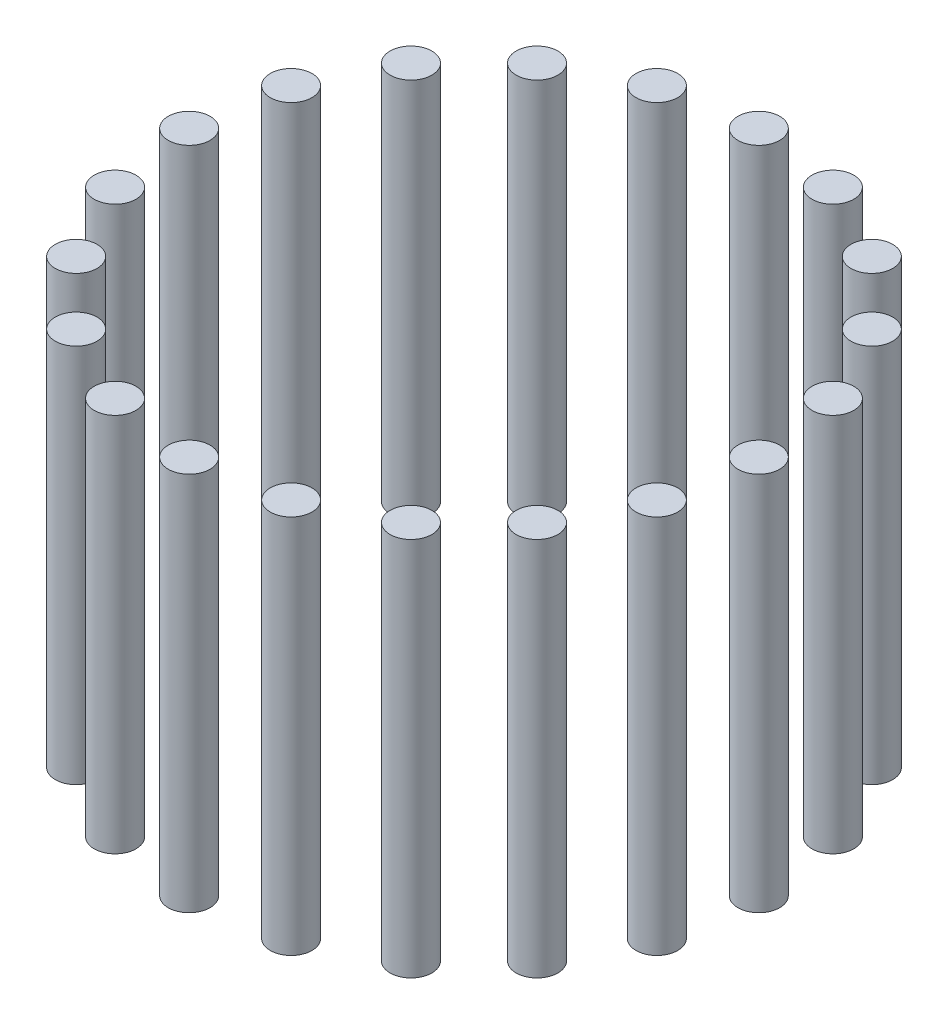
ISO-10303-21;
HEADER;
FILE_DESCRIPTION(('STEP AP214'),'2;1');
FILE_NAME('part.step','',(''),(''),'','','');
FILE_SCHEMA(('AUTOMOTIVE_DESIGN { 1 0 10303 214 1 1 1 1 }'));
ENDSEC;
DATA;
#1=APPLICATION_CONTEXT('core data for automotive mechanical design processes');
#2=APPLICATION_PROTOCOL_DEFINITION('international standard','automotive_design',2000,#1);
#3=PRODUCT_CONTEXT('',#1,'mechanical');
#4=PRODUCT('Part','Part','',(#3));
#5=PRODUCT_RELATED_PRODUCT_CATEGORY('part','',(#4));
#6=PRODUCT_DEFINITION_FORMATION('','',#4);
#7=PRODUCT_DEFINITION_CONTEXT('part definition',#1,'design');
#8=PRODUCT_DEFINITION('design','',#6,#7);
#9=PRODUCT_DEFINITION_SHAPE('','',#8);
#10=(LENGTH_UNIT() NAMED_UNIT(*) SI_UNIT(.MILLI.,.METRE.));
#11=(NAMED_UNIT(*) PLANE_ANGLE_UNIT() SI_UNIT($,.RADIAN.));
#12=(NAMED_UNIT(*) SI_UNIT($,.STERADIAN.) SOLID_ANGLE_UNIT());
#13=UNCERTAINTY_MEASURE_WITH_UNIT(LENGTH_MEASURE(1.E-05),#10,'distance_accuracy_value','');
#14=(GEOMETRIC_REPRESENTATION_CONTEXT(3) GLOBAL_UNCERTAINTY_ASSIGNED_CONTEXT((#13)) GLOBAL_UNIT_ASSIGNED_CONTEXT((#10,
#11,#12)) REPRESENTATION_CONTEXT('',''));
#15=CARTESIAN_POINT('',(0.,0.,0.));
#16=DIRECTION('',(0.,0.,1.));
#17=DIRECTION('',(1.,0.,0.));
#18=AXIS2_PLACEMENT_3D('',#15,#16,#17);
#19=CARTESIAN_POINT('',(-23.1762745781201,100.,-71.329238722135));
#20=DIRECTION('',(0.,-1.,0.));
#21=DIRECTION('',(0.,0.,-1.));
#22=AXIS2_PLACEMENT_3D('',#19,#20,#21);
#23=CYLINDRICAL_SURFACE('',#22,5.50000000000195);
#24=CARTESIAN_POINT('',(-23.1762745781201,100.,-71.329238722135));
#25=DIRECTION('',(0.,1.,0.));
#26=DIRECTION('',(0.,0.,1.));
#27=AXIS2_PLACEMENT_3D('',#24,#25,#26);
#28=CIRCLE('',#27,5.50000000000195);
#29=CARTESIAN_POINT('',(-23.1762745781201,100.,-65.829238722133));
#30=VERTEX_POINT('',#29);
#31=EDGE_CURVE('E48',#30,#30,#28,.T.);
#32=ORIENTED_EDGE('',*,*,#31,.F.);
#33=EDGE_LOOP('',(#32));
#34=FACE_BOUND('',#33,.T.);
#35=CARTESIAN_POINT('',(-23.1762745781201,0.,-71.329238722135));
#36=DIRECTION('',(0.,1.,0.));
#37=DIRECTION('',(0.,0.,1.));
#38=AXIS2_PLACEMENT_3D('',#35,#36,#37);
#39=CIRCLE('',#38,5.50000000000195);
#40=CARTESIAN_POINT('',(-23.1762745781201,0.,-65.829238722133));
#41=VERTEX_POINT('',#40);
#42=EDGE_CURVE('E11',#41,#41,#39,.T.);
#43=ORIENTED_EDGE('',*,*,#42,.T.);
#44=EDGE_LOOP('',(#43));
#45=FACE_BOUND('',#44,.T.);
#46=ADVANCED_FACE('F44',(#34,#45),#23,.T.);
#47=CARTESIAN_POINT('',(-23.1762745781201,100.,-71.329238722135));
#48=DIRECTION('',(0.,1.,0.));
#49=DIRECTION('',(0.,0.,1.));
#50=AXIS2_PLACEMENT_3D('',#47,#48,#49);
#51=PLANE('',#50);
#52=ORIENTED_EDGE('',*,*,#31,.T.);
#53=EDGE_LOOP('',(#52));
#54=FACE_BOUND('',#53,.T.);
#55=ADVANCED_FACE('F46',(#54),#51,.T.);
#56=CARTESIAN_POINT('',(-23.1762745781201,0.,-71.329238722135));
#57=DIRECTION('',(0.,1.,0.));
#58=DIRECTION('',(0.,0.,1.));
#59=AXIS2_PLACEMENT_3D('',#56,#57,#58);
#60=PLANE('',#59);
#61=ORIENTED_EDGE('',*,*,#42,.F.);
#62=EDGE_LOOP('',(#61));
#63=FACE_BOUND('',#62,.T.);
#64=ADVANCED_FACE('F63',(#63),#60,.F.);
#65=CLOSED_SHELL('',(#46,#55,#64));
#66=MANIFOLD_SOLID_BREP('B2',#65);
#67=CARTESIAN_POINT('',(-44.0838939219342,100.,-60.6762745781189));
#68=DIRECTION('',(0.,-1.,0.));
#69=DIRECTION('',(0.,0.,-1.));
#70=AXIS2_PLACEMENT_3D('',#67,#68,#69);
#71=CYLINDRICAL_SURFACE('',#70,5.50000000000278);
#72=CARTESIAN_POINT('',(-44.0838939219342,100.,-60.6762745781189));
#73=DIRECTION('',(0.,1.,0.));
#74=DIRECTION('',(0.,0.,1.));
#75=AXIS2_PLACEMENT_3D('',#72,#73,#74);
#76=CIRCLE('',#75,5.50000000000278);
#77=CARTESIAN_POINT('',(-44.0838939219342,100.,-55.1762745781162));
#78=VERTEX_POINT('',#77);
#79=EDGE_CURVE('E103',#78,#78,#76,.T.);
#80=ORIENTED_EDGE('',*,*,#79,.F.);
#81=EDGE_LOOP('',(#80));
#82=FACE_BOUND('',#81,.T.);
#83=CARTESIAN_POINT('',(-44.0838939219342,0.,-60.6762745781189));
#84=DIRECTION('',(0.,1.,0.));
#85=DIRECTION('',(0.,0.,1.));
#86=AXIS2_PLACEMENT_3D('',#83,#84,#85);
#87=CIRCLE('',#86,5.50000000000278);
#88=CARTESIAN_POINT('',(-44.0838939219342,0.,-55.1762745781162));
#89=VERTEX_POINT('',#88);
#90=EDGE_CURVE('E43',#89,#89,#87,.T.);
#91=ORIENTED_EDGE('',*,*,#90,.T.);
#92=EDGE_LOOP('',(#91));
#93=FACE_BOUND('',#92,.T.);
#94=ADVANCED_FACE('F99',(#82,#93),#71,.T.);
#95=CARTESIAN_POINT('',(-44.0838939219342,100.,-60.6762745781189));
#96=DIRECTION('',(0.,1.,0.));
#97=DIRECTION('',(0.,0.,1.));
#98=AXIS2_PLACEMENT_3D('',#95,#96,#97);
#99=PLANE('',#98);
#100=ORIENTED_EDGE('',*,*,#79,.T.);
#101=EDGE_LOOP('',(#100));
#102=FACE_BOUND('',#101,.T.);
#103=ADVANCED_FACE('F101',(#102),#99,.T.);
#104=CARTESIAN_POINT('',(-44.0838939219342,0.,-60.6762745781189));
#105=DIRECTION('',(0.,1.,0.));
#106=DIRECTION('',(0.,0.,1.));
#107=AXIS2_PLACEMENT_3D('',#104,#105,#106);
#108=PLANE('',#107);
#109=ORIENTED_EDGE('',*,*,#90,.F.);
#110=EDGE_LOOP('',(#109));
#111=FACE_BOUND('',#110,.T.);
#112=ADVANCED_FACE('F118',(#111),#108,.F.);
#113=CLOSED_SHELL('',(#94,#103,#112));
#114=MANIFOLD_SOLID_BREP('B6',#113);
#115=CARTESIAN_POINT('',(-60.6762745781193,100.,-44.0838939219329));
#116=DIRECTION('',(0.,-1.,0.));
#117=DIRECTION('',(0.,0.,-1.));
#118=AXIS2_PLACEMENT_3D('',#115,#116,#117);
#119=CYLINDRICAL_SURFACE('',#118,5.50000000000356);
#120=CARTESIAN_POINT('',(-60.6762745781193,100.,-44.0838939219329));
#121=DIRECTION('',(0.,1.,0.));
#122=DIRECTION('',(0.,0.,1.));
#123=AXIS2_PLACEMENT_3D('',#120,#121,#122);
#124=CIRCLE('',#123,5.50000000000356);
#125=CARTESIAN_POINT('',(-60.6762745781193,100.,-38.5838939219293));
#126=VERTEX_POINT('',#125);
#127=EDGE_CURVE('E158',#126,#126,#124,.T.);
#128=ORIENTED_EDGE('',*,*,#127,.F.);
#129=EDGE_LOOP('',(#128));
#130=FACE_BOUND('',#129,.T.);
#131=CARTESIAN_POINT('',(-60.6762745781193,0.,-44.0838939219329));
#132=DIRECTION('',(0.,1.,0.));
#133=DIRECTION('',(0.,0.,1.));
#134=AXIS2_PLACEMENT_3D('',#131,#132,#133);
#135=CIRCLE('',#134,5.50000000000356);
#136=CARTESIAN_POINT('',(-60.6762745781193,0.,-38.5838939219293));
#137=VERTEX_POINT('',#136);
#138=EDGE_CURVE('E98',#137,#137,#135,.T.);
#139=ORIENTED_EDGE('',*,*,#138,.T.);
#140=EDGE_LOOP('',(#139));
#141=FACE_BOUND('',#140,.T.);
#142=ADVANCED_FACE('F154',(#130,#141),#119,.T.);
#143=CARTESIAN_POINT('',(-60.6762745781193,100.,-44.0838939219329));
#144=DIRECTION('',(0.,1.,0.));
#145=DIRECTION('',(0.,0.,1.));
#146=AXIS2_PLACEMENT_3D('',#143,#144,#145);
#147=PLANE('',#146);
#148=ORIENTED_EDGE('',*,*,#127,.T.);
#149=EDGE_LOOP('',(#148));
#150=FACE_BOUND('',#149,.T.);
#151=ADVANCED_FACE('F156',(#150),#147,.T.);
#152=CARTESIAN_POINT('',(-60.6762745781193,0.,-44.0838939219329));
#153=DIRECTION('',(0.,1.,0.));
#154=DIRECTION('',(0.,0.,1.));
#155=AXIS2_PLACEMENT_3D('',#152,#153,#154);
#156=PLANE('',#155);
#157=ORIENTED_EDGE('',*,*,#138,.F.);
#158=EDGE_LOOP('',(#157));
#159=FACE_BOUND('',#158,.T.);
#160=ADVANCED_FACE('F173',(#159),#156,.F.);
#161=CLOSED_SHELL('',(#142,#151,#160));
#162=MANIFOLD_SOLID_BREP('B38',#161);
#163=CARTESIAN_POINT('',(-71.3292387221342,100.,-23.1762745781181));
#164=DIRECTION('',(0.,-1.,0.));
#165=DIRECTION('',(0.,0.,-1.));
#166=AXIS2_PLACEMENT_3D('',#163,#164,#165);
#167=CYLINDRICAL_SURFACE('',#166,5.50000000000451);
#168=CARTESIAN_POINT('',(-71.3292387221342,100.,-23.1762745781181));
#169=DIRECTION('',(0.,1.,0.));
#170=DIRECTION('',(0.,0.,1.));
#171=AXIS2_PLACEMENT_3D('',#168,#169,#170);
#172=CIRCLE('',#171,5.50000000000451);
#173=CARTESIAN_POINT('',(-71.3292387221342,100.,-17.6762745781136));
#174=VERTEX_POINT('',#173);
#175=EDGE_CURVE('E213',#174,#174,#172,.T.);
#176=ORIENTED_EDGE('',*,*,#175,.F.);
#177=EDGE_LOOP('',(#176));
#178=FACE_BOUND('',#177,.T.);
#179=CARTESIAN_POINT('',(-71.3292387221342,0.,-23.1762745781181));
#180=DIRECTION('',(0.,1.,0.));
#181=DIRECTION('',(0.,0.,1.));
#182=AXIS2_PLACEMENT_3D('',#179,#180,#181);
#183=CIRCLE('',#182,5.50000000000451);
#184=CARTESIAN_POINT('',(-71.3292387221342,0.,-17.6762745781136));
#185=VERTEX_POINT('',#184);
#186=EDGE_CURVE('E153',#185,#185,#183,.T.);
#187=ORIENTED_EDGE('',*,*,#186,.T.);
#188=EDGE_LOOP('',(#187));
#189=FACE_BOUND('',#188,.T.);
#190=ADVANCED_FACE('F209',(#178,#189),#167,.T.);
#191=CARTESIAN_POINT('',(-71.3292387221342,100.,-23.1762745781181));
#192=DIRECTION('',(0.,1.,0.));
#193=DIRECTION('',(0.,0.,1.));
#194=AXIS2_PLACEMENT_3D('',#191,#192,#193);
#195=PLANE('',#194);
#196=ORIENTED_EDGE('',*,*,#175,.T.);
#197=EDGE_LOOP('',(#196));
#198=FACE_BOUND('',#197,.T.);
#199=ADVANCED_FACE('F211',(#198),#195,.T.);
#200=CARTESIAN_POINT('',(-71.3292387221342,0.,-23.1762745781181));
#201=DIRECTION('',(0.,1.,0.));
#202=DIRECTION('',(0.,0.,1.));
#203=AXIS2_PLACEMENT_3D('',#200,#201,#202);
#204=PLANE('',#203);
#205=ORIENTED_EDGE('',*,*,#186,.F.);
#206=EDGE_LOOP('',(#205));
#207=FACE_BOUND('',#206,.T.);
#208=ADVANCED_FACE('F228',(#207),#204,.F.);
#209=CLOSED_SHELL('',(#190,#199,#208));
#210=MANIFOLD_SOLID_BREP('B93',#209);
#211=CARTESIAN_POINT('',(-74.9999999999969,100.,3.0739299994309E-12));
#212=DIRECTION('',(0.,-1.,0.));
#213=DIRECTION('',(0.,0.,-1.));
#214=AXIS2_PLACEMENT_3D('',#211,#212,#213);
#215=CYLINDRICAL_SURFACE('',#214,5.50000000000537);
#216=CARTESIAN_POINT('',(-74.9999999999969,100.,3.0739299994309E-12));
#217=DIRECTION('',(0.,1.,0.));
#218=DIRECTION('',(0.,0.,1.));
#219=AXIS2_PLACEMENT_3D('',#216,#217,#218);
#220=CIRCLE('',#219,5.50000000000537);
#221=CARTESIAN_POINT('',(-74.9999999999969,100.,5.50000000000844));
#222=VERTEX_POINT('',#221);
#223=EDGE_CURVE('E268',#222,#222,#220,.T.);
#224=ORIENTED_EDGE('',*,*,#223,.F.);
#225=EDGE_LOOP('',(#224));
#226=FACE_BOUND('',#225,.T.);
#227=CARTESIAN_POINT('',(-74.9999999999969,0.,3.0739299994309E-12));
#228=DIRECTION('',(0.,1.,0.));
#229=DIRECTION('',(0.,0.,1.));
#230=AXIS2_PLACEMENT_3D('',#227,#228,#229);
#231=CIRCLE('',#230,5.50000000000537);
#232=CARTESIAN_POINT('',(-74.9999999999969,0.,5.50000000000844));
#233=VERTEX_POINT('',#232);
#234=EDGE_CURVE('E208',#233,#233,#231,.T.);
#235=ORIENTED_EDGE('',*,*,#234,.T.);
#236=EDGE_LOOP('',(#235));
#237=FACE_BOUND('',#236,.T.);
#238=ADVANCED_FACE('F264',(#226,#237),#215,.T.);
#239=CARTESIAN_POINT('',(-74.9999999999969,100.,3.0739299994309E-12));
#240=DIRECTION('',(0.,1.,0.));
#241=DIRECTION('',(0.,0.,1.));
#242=AXIS2_PLACEMENT_3D('',#239,#240,#241);
#243=PLANE('',#242);
#244=ORIENTED_EDGE('',*,*,#223,.T.);
#245=EDGE_LOOP('',(#244));
#246=FACE_BOUND('',#245,.T.);
#247=ADVANCED_FACE('F266',(#246),#243,.T.);
#248=CARTESIAN_POINT('',(-74.9999999999969,0.,3.0739299994309E-12));
#249=DIRECTION('',(0.,1.,0.));
#250=DIRECTION('',(0.,0.,1.));
#251=AXIS2_PLACEMENT_3D('',#248,#249,#250);
#252=PLANE('',#251);
#253=ORIENTED_EDGE('',*,*,#234,.F.);
#254=EDGE_LOOP('',(#253));
#255=FACE_BOUND('',#254,.T.);
#256=ADVANCED_FACE('F283',(#255),#252,.F.);
#257=CLOSED_SHELL('',(#238,#247,#256));
#258=MANIFOLD_SOLID_BREP('B148',#257);
#259=CARTESIAN_POINT('',(-71.3292387221327,100.,23.176274578124));
#260=DIRECTION('',(0.,-1.,0.));
#261=DIRECTION('',(0.,0.,-1.));
#262=AXIS2_PLACEMENT_3D('',#259,#260,#261);
#263=CYLINDRICAL_SURFACE('',#262,5.500000000006);
#264=CARTESIAN_POINT('',(-71.3292387221327,100.,23.176274578124));
#265=DIRECTION('',(0.,1.,0.));
#266=DIRECTION('',(0.,0.,1.));
#267=AXIS2_PLACEMENT_3D('',#264,#265,#266);
#268=CIRCLE('',#267,5.500000000006);
#269=CARTESIAN_POINT('',(-71.3292387221327,100.,28.67627457813));
#270=VERTEX_POINT('',#269);
#271=EDGE_CURVE('E323',#270,#270,#268,.T.);
#272=ORIENTED_EDGE('',*,*,#271,.F.);
#273=EDGE_LOOP('',(#272));
#274=FACE_BOUND('',#273,.T.);
#275=CARTESIAN_POINT('',(-71.3292387221327,0.,23.176274578124));
#276=DIRECTION('',(0.,1.,0.));
#277=DIRECTION('',(0.,0.,1.));
#278=AXIS2_PLACEMENT_3D('',#275,#276,#277);
#279=CIRCLE('',#278,5.500000000006);
#280=CARTESIAN_POINT('',(-71.3292387221327,0.,28.67627457813));
#281=VERTEX_POINT('',#280);
#282=EDGE_CURVE('E263',#281,#281,#279,.T.);
#283=ORIENTED_EDGE('',*,*,#282,.T.);
#284=EDGE_LOOP('',(#283));
#285=FACE_BOUND('',#284,.T.);
#286=ADVANCED_FACE('F319',(#274,#285),#263,.T.);
#287=CARTESIAN_POINT('',(-71.3292387221327,100.,23.176274578124));
#288=DIRECTION('',(0.,1.,0.));
#289=DIRECTION('',(0.,0.,1.));
#290=AXIS2_PLACEMENT_3D('',#287,#288,#289);
#291=PLANE('',#290);
#292=ORIENTED_EDGE('',*,*,#271,.T.);
#293=EDGE_LOOP('',(#292));
#294=FACE_BOUND('',#293,.T.);
#295=ADVANCED_FACE('F321',(#294),#291,.T.);
#296=CARTESIAN_POINT('',(-71.3292387221327,0.,23.176274578124));
#297=DIRECTION('',(0.,1.,0.));
#298=DIRECTION('',(0.,0.,1.));
#299=AXIS2_PLACEMENT_3D('',#296,#297,#298);
#300=PLANE('',#299);
#301=ORIENTED_EDGE('',*,*,#282,.F.);
#302=EDGE_LOOP('',(#301));
#303=FACE_BOUND('',#302,.T.);
#304=ADVANCED_FACE('F338',(#303),#300,.F.);
#305=CLOSED_SHELL('',(#286,#295,#304));
#306=MANIFOLD_SOLID_BREP('B203',#305);
#307=CARTESIAN_POINT('',(-60.6762745781165,100.,44.0838939219381));
#308=DIRECTION('',(0.,-1.,0.));
#309=DIRECTION('',(0.,0.,-1.));
#310=AXIS2_PLACEMENT_3D('',#307,#308,#309);
#311=CYLINDRICAL_SURFACE('',#310,5.50000000000652);
#312=CARTESIAN_POINT('',(-60.6762745781165,100.,44.0838939219381));
#313=DIRECTION('',(0.,1.,0.));
#314=DIRECTION('',(0.,0.,1.));
#315=AXIS2_PLACEMENT_3D('',#312,#313,#314);
#316=CIRCLE('',#315,5.50000000000652);
#317=CARTESIAN_POINT('',(-60.6762745781165,100.,49.5838939219446));
#318=VERTEX_POINT('',#317);
#319=EDGE_CURVE('E378',#318,#318,#316,.T.);
#320=ORIENTED_EDGE('',*,*,#319,.F.);
#321=EDGE_LOOP('',(#320));
#322=FACE_BOUND('',#321,.T.);
#323=CARTESIAN_POINT('',(-60.6762745781165,0.,44.0838939219381));
#324=DIRECTION('',(0.,1.,0.));
#325=DIRECTION('',(0.,0.,1.));
#326=AXIS2_PLACEMENT_3D('',#323,#324,#325);
#327=CIRCLE('',#326,5.50000000000652);
#328=CARTESIAN_POINT('',(-60.6762745781165,0.,49.5838939219446));
#329=VERTEX_POINT('',#328);
#330=EDGE_CURVE('E318',#329,#329,#327,.T.);
#331=ORIENTED_EDGE('',*,*,#330,.T.);
#332=EDGE_LOOP('',(#331));
#333=FACE_BOUND('',#332,.T.);
#334=ADVANCED_FACE('F374',(#322,#333),#311,.T.);
#335=CARTESIAN_POINT('',(-60.6762745781165,100.,44.0838939219381));
#336=DIRECTION('',(0.,1.,0.));
#337=DIRECTION('',(0.,0.,1.));
#338=AXIS2_PLACEMENT_3D('',#335,#336,#337);
#339=PLANE('',#338);
#340=ORIENTED_EDGE('',*,*,#319,.T.);
#341=EDGE_LOOP('',(#340));
#342=FACE_BOUND('',#341,.T.);
#343=ADVANCED_FACE('F376',(#342),#339,.T.);
#344=CARTESIAN_POINT('',(-60.6762745781165,0.,44.0838939219381));
#345=DIRECTION('',(0.,1.,0.));
#346=DIRECTION('',(0.,0.,1.));
#347=AXIS2_PLACEMENT_3D('',#344,#345,#346);
#348=PLANE('',#347);
#349=ORIENTED_EDGE('',*,*,#330,.F.);
#350=EDGE_LOOP('',(#349));
#351=FACE_BOUND('',#350,.T.);
#352=ADVANCED_FACE('F393',(#351),#348,.F.);
#353=CLOSED_SHELL('',(#334,#343,#352));
#354=MANIFOLD_SOLID_BREP('B258',#353);
#355=CARTESIAN_POINT('',(-44.0838939219303,100.,60.6762745781231));
#356=DIRECTION('',(0.,-1.,0.));
#357=DIRECTION('',(0.,0.,-1.));
#358=AXIS2_PLACEMENT_3D('',#355,#356,#357);
#359=CYLINDRICAL_SURFACE('',#358,5.50000000000675);
#360=CARTESIAN_POINT('',(-44.0838939219303,100.,60.6762745781231));
#361=DIRECTION('',(0.,1.,0.));
#362=DIRECTION('',(0.,0.,1.));
#363=AXIS2_PLACEMENT_3D('',#360,#361,#362);
#364=CIRCLE('',#363,5.50000000000675);
#365=CARTESIAN_POINT('',(-44.0838939219303,100.,66.1762745781299));
#366=VERTEX_POINT('',#365);
#367=EDGE_CURVE('E433',#366,#366,#364,.T.);
#368=ORIENTED_EDGE('',*,*,#367,.F.);
#369=EDGE_LOOP('',(#368));
#370=FACE_BOUND('',#369,.T.);
#371=CARTESIAN_POINT('',(-44.0838939219303,0.,60.6762745781231));
#372=DIRECTION('',(0.,1.,0.));
#373=DIRECTION('',(0.,0.,1.));
#374=AXIS2_PLACEMENT_3D('',#371,#372,#373);
#375=CIRCLE('',#374,5.50000000000675);
#376=CARTESIAN_POINT('',(-44.0838939219303,0.,66.1762745781299));
#377=VERTEX_POINT('',#376);
#378=EDGE_CURVE('E373',#377,#377,#375,.T.);
#379=ORIENTED_EDGE('',*,*,#378,.T.);
#380=EDGE_LOOP('',(#379));
#381=FACE_BOUND('',#380,.T.);
#382=ADVANCED_FACE('F429',(#370,#381),#359,.T.);
#383=CARTESIAN_POINT('',(-44.0838939219303,100.,60.6762745781231));
#384=DIRECTION('',(0.,1.,0.));
#385=DIRECTION('',(0.,0.,1.));
#386=AXIS2_PLACEMENT_3D('',#383,#384,#385);
#387=PLANE('',#386);
#388=ORIENTED_EDGE('',*,*,#367,.T.);
#389=EDGE_LOOP('',(#388));
#390=FACE_BOUND('',#389,.T.);
#391=ADVANCED_FACE('F431',(#390),#387,.T.);
#392=CARTESIAN_POINT('',(-44.0838939219303,0.,60.6762745781231));
#393=DIRECTION('',(0.,1.,0.));
#394=DIRECTION('',(0.,0.,1.));
#395=AXIS2_PLACEMENT_3D('',#392,#393,#394);
#396=PLANE('',#395);
#397=ORIENTED_EDGE('',*,*,#378,.F.);
#398=EDGE_LOOP('',(#397));
#399=FACE_BOUND('',#398,.T.);
#400=ADVANCED_FACE('F448',(#399),#396,.F.);
#401=CLOSED_SHELL('',(#382,#391,#400));
#402=MANIFOLD_SOLID_BREP('B313',#401);
#403=CARTESIAN_POINT('',(-23.1762745781154,100.,71.3292387221379));
#404=DIRECTION('',(0.,-1.,0.));
#405=DIRECTION('',(0.,0.,-1.));
#406=AXIS2_PLACEMENT_3D('',#403,#404,#405);
#407=CYLINDRICAL_SURFACE('',#406,5.50000000000673);
#408=CARTESIAN_POINT('',(-23.1762745781154,100.,71.3292387221379));
#409=DIRECTION('',(0.,1.,0.));
#410=DIRECTION('',(0.,0.,1.));
#411=AXIS2_PLACEMENT_3D('',#408,#409,#410);
#412=CIRCLE('',#411,5.50000000000673);
#413=CARTESIAN_POINT('',(-23.1762745781154,100.,76.8292387221446));
#414=VERTEX_POINT('',#413);
#415=EDGE_CURVE('E488',#414,#414,#412,.T.);
#416=ORIENTED_EDGE('',*,*,#415,.F.);
#417=EDGE_LOOP('',(#416));
#418=FACE_BOUND('',#417,.T.);
#419=CARTESIAN_POINT('',(-23.1762745781154,0.,71.3292387221379));
#420=DIRECTION('',(0.,1.,0.));
#421=DIRECTION('',(0.,0.,1.));
#422=AXIS2_PLACEMENT_3D('',#419,#420,#421);
#423=CIRCLE('',#422,5.50000000000673);
#424=CARTESIAN_POINT('',(-23.1762745781154,0.,76.8292387221446));
#425=VERTEX_POINT('',#424);
#426=EDGE_CURVE('E428',#425,#425,#423,.T.);
#427=ORIENTED_EDGE('',*,*,#426,.T.);
#428=EDGE_LOOP('',(#427));
#429=FACE_BOUND('',#428,.T.);
#430=ADVANCED_FACE('F484',(#418,#429),#407,.T.);
#431=CARTESIAN_POINT('',(-23.1762745781154,100.,71.3292387221379));
#432=DIRECTION('',(0.,1.,0.));
#433=DIRECTION('',(0.,0.,1.));
#434=AXIS2_PLACEMENT_3D('',#431,#432,#433);
#435=PLANE('',#434);
#436=ORIENTED_EDGE('',*,*,#415,.T.);
#437=EDGE_LOOP('',(#436));
#438=FACE_BOUND('',#437,.T.);
#439=ADVANCED_FACE('F486',(#438),#435,.T.);
#440=CARTESIAN_POINT('',(-23.1762745781154,0.,71.3292387221379));
#441=DIRECTION('',(0.,1.,0.));
#442=DIRECTION('',(0.,0.,1.));
#443=AXIS2_PLACEMENT_3D('',#440,#441,#442);
#444=PLANE('',#443);
#445=ORIENTED_EDGE('',*,*,#426,.F.);
#446=EDGE_LOOP('',(#445));
#447=FACE_BOUND('',#446,.T.);
#448=ADVANCED_FACE('F503',(#447),#444,.F.);
#449=CLOSED_SHELL('',(#430,#439,#448));
#450=MANIFOLD_SOLID_BREP('B368',#449);
#451=CARTESIAN_POINT('',(4.75140760070047E-12,100.,75.0000000000005));
#452=DIRECTION('',(0.,-1.,0.));
#453=DIRECTION('',(0.,0.,-1.));
#454=AXIS2_PLACEMENT_3D('',#451,#452,#453);
#455=CYLINDRICAL_SURFACE('',#454,5.5000000000064);
#456=CARTESIAN_POINT('',(4.75140760070047E-12,100.,75.0000000000005));
#457=DIRECTION('',(0.,1.,0.));
#458=DIRECTION('',(0.,0.,1.));
#459=AXIS2_PLACEMENT_3D('',#456,#457,#458);
#460=CIRCLE('',#459,5.5000000000064);
#461=CARTESIAN_POINT('',(4.75140760070047E-12,100.,80.5000000000069));
#462=VERTEX_POINT('',#461);
#463=EDGE_CURVE('E543',#462,#462,#460,.T.);
#464=ORIENTED_EDGE('',*,*,#463,.F.);
#465=EDGE_LOOP('',(#464));
#466=FACE_BOUND('',#465,.T.);
#467=CARTESIAN_POINT('',(4.75140760070047E-12,0.,75.0000000000005));
#468=DIRECTION('',(0.,1.,0.));
#469=DIRECTION('',(0.,0.,1.));
#470=AXIS2_PLACEMENT_3D('',#467,#468,#469);
#471=CIRCLE('',#470,5.5000000000064);
#472=CARTESIAN_POINT('',(4.75140760070047E-12,0.,80.5000000000069));
#473=VERTEX_POINT('',#472);
#474=EDGE_CURVE('E483',#473,#473,#471,.T.);
#475=ORIENTED_EDGE('',*,*,#474,.T.);
#476=EDGE_LOOP('',(#475));
#477=FACE_BOUND('',#476,.T.);
#478=ADVANCED_FACE('F539',(#466,#477),#455,.T.);
#479=CARTESIAN_POINT('',(4.75140760070047E-12,100.,75.0000000000005));
#480=DIRECTION('',(0.,1.,0.));
#481=DIRECTION('',(0.,0.,1.));
#482=AXIS2_PLACEMENT_3D('',#479,#480,#481);
#483=PLANE('',#482);
#484=ORIENTED_EDGE('',*,*,#463,.T.);
#485=EDGE_LOOP('',(#484));
#486=FACE_BOUND('',#485,.T.);
#487=ADVANCED_FACE('F541',(#486),#483,.T.);
#488=CARTESIAN_POINT('',(4.75140760070047E-12,0.,75.0000000000005));
#489=DIRECTION('',(0.,1.,0.));
#490=DIRECTION('',(0.,0.,1.));
#491=AXIS2_PLACEMENT_3D('',#488,#489,#490);
#492=PLANE('',#491);
#493=ORIENTED_EDGE('',*,*,#474,.F.);
#494=EDGE_LOOP('',(#493));
#495=FACE_BOUND('',#494,.T.);
#496=ADVANCED_FACE('F558',(#495),#492,.F.);
#497=CLOSED_SHELL('',(#478,#487,#496));
#498=MANIFOLD_SOLID_BREP('B423',#497);
#499=CARTESIAN_POINT('',(23.1762745781258,100.,71.3292387221365));
#500=DIRECTION('',(0.,-1.,0.));
#501=DIRECTION('',(0.,0.,-1.));
#502=AXIS2_PLACEMENT_3D('',#499,#500,#501);
#503=CYLINDRICAL_SURFACE('',#502,5.5000000000058);
#504=CARTESIAN_POINT('',(23.1762745781258,100.,71.3292387221365));
#505=DIRECTION('',(0.,1.,0.));
#506=DIRECTION('',(0.,0.,1.));
#507=AXIS2_PLACEMENT_3D('',#504,#505,#506);
#508=CIRCLE('',#507,5.5000000000058);
#509=CARTESIAN_POINT('',(23.1762745781258,100.,76.8292387221423));
#510=VERTEX_POINT('',#509);
#511=EDGE_CURVE('E598',#510,#510,#508,.T.);
#512=ORIENTED_EDGE('',*,*,#511,.F.);
#513=EDGE_LOOP('',(#512));
#514=FACE_BOUND('',#513,.T.);
#515=CARTESIAN_POINT('',(23.1762745781258,0.,71.3292387221365));
#516=DIRECTION('',(0.,1.,0.));
#517=DIRECTION('',(0.,0.,1.));
#518=AXIS2_PLACEMENT_3D('',#515,#516,#517);
#519=CIRCLE('',#518,5.5000000000058);
#520=CARTESIAN_POINT('',(23.1762745781258,0.,76.8292387221423));
#521=VERTEX_POINT('',#520);
#522=EDGE_CURVE('E538',#521,#521,#519,.T.);
#523=ORIENTED_EDGE('',*,*,#522,.T.);
#524=EDGE_LOOP('',(#523));
#525=FACE_BOUND('',#524,.T.);
#526=ADVANCED_FACE('F594',(#514,#525),#503,.T.);
#527=CARTESIAN_POINT('',(23.1762745781258,100.,71.3292387221365));
#528=DIRECTION('',(0.,1.,0.));
#529=DIRECTION('',(0.,0.,1.));
#530=AXIS2_PLACEMENT_3D('',#527,#528,#529);
#531=PLANE('',#530);
#532=ORIENTED_EDGE('',*,*,#511,.T.);
#533=EDGE_LOOP('',(#532));
#534=FACE_BOUND('',#533,.T.);
#535=ADVANCED_FACE('F596',(#534),#531,.T.);
#536=CARTESIAN_POINT('',(23.1762745781258,0.,71.3292387221365));
#537=DIRECTION('',(0.,1.,0.));
#538=DIRECTION('',(0.,0.,1.));
#539=AXIS2_PLACEMENT_3D('',#536,#537,#538);
#540=PLANE('',#539);
#541=ORIENTED_EDGE('',*,*,#522,.F.);
#542=EDGE_LOOP('',(#541));
#543=FACE_BOUND('',#542,.T.);
#544=ADVANCED_FACE('F613',(#543),#540,.F.);
#545=CLOSED_SHELL('',(#526,#535,#544));
#546=MANIFOLD_SOLID_BREP('B478',#545);
#547=CARTESIAN_POINT('',(44.08389392194,100.,60.6762745781204));
#548=DIRECTION('',(0.,-1.,0.));
#549=DIRECTION('',(0.,0.,-1.));
#550=AXIS2_PLACEMENT_3D('',#547,#548,#549);
#551=CYLINDRICAL_SURFACE('',#550,5.50000000000501);
#552=CARTESIAN_POINT('',(44.08389392194,100.,60.6762745781204));
#553=DIRECTION('',(0.,1.,0.));
#554=DIRECTION('',(0.,0.,1.));
#555=AXIS2_PLACEMENT_3D('',#552,#553,#554);
#556=CIRCLE('',#555,5.50000000000501);
#557=CARTESIAN_POINT('',(44.08389392194,100.,66.1762745781254));
#558=VERTEX_POINT('',#557);
#559=EDGE_CURVE('E653',#558,#558,#556,.T.);
#560=ORIENTED_EDGE('',*,*,#559,.F.);
#561=EDGE_LOOP('',(#560));
#562=FACE_BOUND('',#561,.T.);
#563=CARTESIAN_POINT('',(44.08389392194,0.,60.6762745781204));
#564=DIRECTION('',(0.,1.,0.));
#565=DIRECTION('',(0.,0.,1.));
#566=AXIS2_PLACEMENT_3D('',#563,#564,#565);
#567=CIRCLE('',#566,5.50000000000501);
#568=CARTESIAN_POINT('',(44.08389392194,0.,66.1762745781254));
#569=VERTEX_POINT('',#568);
#570=EDGE_CURVE('E593',#569,#569,#567,.T.);
#571=ORIENTED_EDGE('',*,*,#570,.T.);
#572=EDGE_LOOP('',(#571));
#573=FACE_BOUND('',#572,.T.);
#574=ADVANCED_FACE('F649',(#562,#573),#551,.T.);
#575=CARTESIAN_POINT('',(44.08389392194,100.,60.6762745781204));
#576=DIRECTION('',(0.,1.,0.));
#577=DIRECTION('',(0.,0.,1.));
#578=AXIS2_PLACEMENT_3D('',#575,#576,#577);
#579=PLANE('',#578);
#580=ORIENTED_EDGE('',*,*,#559,.T.);
#581=EDGE_LOOP('',(#580));
#582=FACE_BOUND('',#581,.T.);
#583=ADVANCED_FACE('F651',(#582),#579,.T.);
#584=CARTESIAN_POINT('',(44.08389392194,0.,60.6762745781204));
#585=DIRECTION('',(0.,1.,0.));
#586=DIRECTION('',(0.,0.,1.));
#587=AXIS2_PLACEMENT_3D('',#584,#585,#586);
#588=PLANE('',#587);
#589=ORIENTED_EDGE('',*,*,#570,.F.);
#590=EDGE_LOOP('',(#589));
#591=FACE_BOUND('',#590,.T.);
#592=ADVANCED_FACE('F668',(#591),#588,.F.);
#593=CLOSED_SHELL('',(#574,#583,#592));
#594=MANIFOLD_SOLID_BREP('B533',#593);
#595=CARTESIAN_POINT('',(60.6762745781253,100.,44.0838939219344));
#596=DIRECTION('',(0.,-1.,0.));
#597=DIRECTION('',(0.,0.,-1.));
#598=AXIS2_PLACEMENT_3D('',#595,#596,#597);
#599=CYLINDRICAL_SURFACE('',#598,5.50000000000408);
#600=CARTESIAN_POINT('',(60.6762745781253,100.,44.0838939219344));
#601=DIRECTION('',(0.,1.,0.));
#602=DIRECTION('',(0.,0.,1.));
#603=AXIS2_PLACEMENT_3D('',#600,#601,#602);
#604=CIRCLE('',#603,5.50000000000408);
#605=CARTESIAN_POINT('',(60.6762745781253,100.,49.5838939219385));
#606=VERTEX_POINT('',#605);
#607=EDGE_CURVE('E708',#606,#606,#604,.T.);
#608=ORIENTED_EDGE('',*,*,#607,.F.);
#609=EDGE_LOOP('',(#608));
#610=FACE_BOUND('',#609,.T.);
#611=CARTESIAN_POINT('',(60.6762745781253,0.,44.0838939219344));
#612=DIRECTION('',(0.,1.,0.));
#613=DIRECTION('',(0.,0.,1.));
#614=AXIS2_PLACEMENT_3D('',#611,#612,#613);
#615=CIRCLE('',#614,5.50000000000408);
#616=CARTESIAN_POINT('',(60.6762745781253,0.,49.5838939219385));
#617=VERTEX_POINT('',#616);
#618=EDGE_CURVE('E648',#617,#617,#615,.T.);
#619=ORIENTED_EDGE('',*,*,#618,.T.);
#620=EDGE_LOOP('',(#619));
#621=FACE_BOUND('',#620,.T.);
#622=ADVANCED_FACE('F704',(#610,#621),#599,.T.);
#623=CARTESIAN_POINT('',(60.6762745781253,100.,44.0838939219344));
#624=DIRECTION('',(0.,1.,0.));
#625=DIRECTION('',(0.,0.,1.));
#626=AXIS2_PLACEMENT_3D('',#623,#624,#625);
#627=PLANE('',#626);
#628=ORIENTED_EDGE('',*,*,#607,.T.);
#629=EDGE_LOOP('',(#628));
#630=FACE_BOUND('',#629,.T.);
#631=ADVANCED_FACE('F706',(#630),#627,.T.);
#632=CARTESIAN_POINT('',(60.6762745781253,0.,44.0838939219344));
#633=DIRECTION('',(0.,1.,0.));
#634=DIRECTION('',(0.,0.,1.));
#635=AXIS2_PLACEMENT_3D('',#632,#633,#634);
#636=PLANE('',#635);
#637=ORIENTED_EDGE('',*,*,#618,.F.);
#638=EDGE_LOOP('',(#637));
#639=FACE_BOUND('',#638,.T.);
#640=ADVANCED_FACE('F723',(#639),#636,.F.);
#641=CLOSED_SHELL('',(#622,#631,#640));
#642=MANIFOLD_SOLID_BREP('B588',#641);
#643=CARTESIAN_POINT('',(71.3292387221403,100.,23.1762745781196));
#644=DIRECTION('',(0.,-1.,0.));
#645=DIRECTION('',(0.,0.,-1.));
#646=AXIS2_PLACEMENT_3D('',#643,#644,#645);
#647=CYLINDRICAL_SURFACE('',#646,5.50000000000309);
#648=CARTESIAN_POINT('',(71.3292387221403,100.,23.1762745781196));
#649=DIRECTION('',(0.,1.,0.));
#650=DIRECTION('',(0.,0.,1.));
#651=AXIS2_PLACEMENT_3D('',#648,#649,#650);
#652=CIRCLE('',#651,5.50000000000309);
#653=CARTESIAN_POINT('',(71.3292387221403,100.,28.6762745781227));
#654=VERTEX_POINT('',#653);
#655=EDGE_CURVE('E763',#654,#654,#652,.T.);
#656=ORIENTED_EDGE('',*,*,#655,.F.);
#657=EDGE_LOOP('',(#656));
#658=FACE_BOUND('',#657,.T.);
#659=CARTESIAN_POINT('',(71.3292387221403,0.,23.1762745781196));
#660=DIRECTION('',(0.,1.,0.));
#661=DIRECTION('',(0.,0.,1.));
#662=AXIS2_PLACEMENT_3D('',#659,#660,#661);
#663=CIRCLE('',#662,5.50000000000309);
#664=CARTESIAN_POINT('',(71.3292387221403,0.,28.6762745781227));
#665=VERTEX_POINT('',#664);
#666=EDGE_CURVE('E703',#665,#665,#663,.T.);
#667=ORIENTED_EDGE('',*,*,#666,.T.);
#668=EDGE_LOOP('',(#667));
#669=FACE_BOUND('',#668,.T.);
#670=ADVANCED_FACE('F759',(#658,#669),#647,.T.);
#671=CARTESIAN_POINT('',(71.3292387221403,100.,23.1762745781196));
#672=DIRECTION('',(0.,1.,0.));
#673=DIRECTION('',(0.,0.,1.));
#674=AXIS2_PLACEMENT_3D('',#671,#672,#673);
#675=PLANE('',#674);
#676=ORIENTED_EDGE('',*,*,#655,.T.);
#677=EDGE_LOOP('',(#676));
#678=FACE_BOUND('',#677,.T.);
#679=ADVANCED_FACE('F761',(#678),#675,.T.);
#680=CARTESIAN_POINT('',(71.3292387221403,0.,23.1762745781196));
#681=DIRECTION('',(0.,1.,0.));
#682=DIRECTION('',(0.,0.,1.));
#683=AXIS2_PLACEMENT_3D('',#680,#681,#682);
#684=PLANE('',#683);
#685=ORIENTED_EDGE('',*,*,#666,.F.);
#686=EDGE_LOOP('',(#685));
#687=FACE_BOUND('',#686,.T.);
#688=ADVANCED_FACE('F778',(#687),#684,.F.);
#689=CLOSED_SHELL('',(#670,#679,#688));
#690=MANIFOLD_SOLID_BREP('B643',#689);
#691=CARTESIAN_POINT('',(75.0000000000032,100.,-1.65926300477182E-12));
#692=DIRECTION('',(0.,-1.,0.));
#693=DIRECTION('',(0.,0.,-1.));
#694=AXIS2_PLACEMENT_3D('',#691,#692,#693);
#695=CYLINDRICAL_SURFACE('',#694,5.50000000000214);
#696=CARTESIAN_POINT('',(75.0000000000032,100.,-1.65926300477182E-12));
#697=DIRECTION('',(0.,1.,0.));
#698=DIRECTION('',(0.,0.,1.));
#699=AXIS2_PLACEMENT_3D('',#696,#697,#698);
#700=CIRCLE('',#699,5.50000000000214);
#701=CARTESIAN_POINT('',(75.0000000000032,100.,5.50000000000048));
#702=VERTEX_POINT('',#701);
#703=EDGE_CURVE('E818',#702,#702,#700,.T.);
#704=ORIENTED_EDGE('',*,*,#703,.F.);
#705=EDGE_LOOP('',(#704));
#706=FACE_BOUND('',#705,.T.);
#707=CARTESIAN_POINT('',(75.0000000000032,0.,-1.65926300477182E-12));
#708=DIRECTION('',(0.,1.,0.));
#709=DIRECTION('',(0.,0.,1.));
#710=AXIS2_PLACEMENT_3D('',#707,#708,#709);
#711=CIRCLE('',#710,5.50000000000214);
#712=CARTESIAN_POINT('',(75.0000000000032,0.,5.50000000000048));
#713=VERTEX_POINT('',#712);
#714=EDGE_CURVE('E758',#713,#713,#711,.T.);
#715=ORIENTED_EDGE('',*,*,#714,.T.);
#716=EDGE_LOOP('',(#715));
#717=FACE_BOUND('',#716,.T.);
#718=ADVANCED_FACE('F814',(#706,#717),#695,.T.);
#719=CARTESIAN_POINT('',(75.0000000000032,100.,-1.65926300477182E-12));
#720=DIRECTION('',(0.,1.,0.));
#721=DIRECTION('',(0.,0.,1.));
#722=AXIS2_PLACEMENT_3D('',#719,#720,#721);
#723=PLANE('',#722);
#724=ORIENTED_EDGE('',*,*,#703,.T.);
#725=EDGE_LOOP('',(#724));
#726=FACE_BOUND('',#725,.T.);
#727=ADVANCED_FACE('F816',(#726),#723,.T.);
#728=CARTESIAN_POINT('',(75.0000000000032,0.,-1.65926300477182E-12));
#729=DIRECTION('',(0.,1.,0.));
#730=DIRECTION('',(0.,0.,1.));
#731=AXIS2_PLACEMENT_3D('',#728,#729,#730);
#732=PLANE('',#731);
#733=ORIENTED_EDGE('',*,*,#714,.F.);
#734=EDGE_LOOP('',(#733));
#735=FACE_BOUND('',#734,.T.);
#736=ADVANCED_FACE('F833',(#735),#732,.F.);
#737=CLOSED_SHELL('',(#718,#727,#736));
#738=MANIFOLD_SOLID_BREP('B698',#737);
#739=CARTESIAN_POINT('',(71.3292387221391,100.,-23.1762745781227));
#740=DIRECTION('',(0.,-1.,0.));
#741=DIRECTION('',(0.,0.,-1.));
#742=AXIS2_PLACEMENT_3D('',#739,#740,#741);
#743=CYLINDRICAL_SURFACE('',#742,5.50000000000127);
#744=CARTESIAN_POINT('',(71.3292387221391,100.,-23.1762745781227));
#745=DIRECTION('',(0.,1.,0.));
#746=DIRECTION('',(0.,0.,1.));
#747=AXIS2_PLACEMENT_3D('',#744,#745,#746);
#748=CIRCLE('',#747,5.50000000000127);
#749=CARTESIAN_POINT('',(71.3292387221391,100.,-17.6762745781214));
#750=VERTEX_POINT('',#749);
#751=EDGE_CURVE('E873',#750,#750,#748,.T.);
#752=ORIENTED_EDGE('',*,*,#751,.F.);
#753=EDGE_LOOP('',(#752));
#754=FACE_BOUND('',#753,.T.);
#755=CARTESIAN_POINT('',(71.3292387221391,0.,-23.1762745781227));
#756=DIRECTION('',(0.,1.,0.));
#757=DIRECTION('',(0.,0.,1.));
#758=AXIS2_PLACEMENT_3D('',#755,#756,#757);
#759=CIRCLE('',#758,5.50000000000127);
#760=CARTESIAN_POINT('',(71.3292387221391,0.,-17.6762745781214));
#761=VERTEX_POINT('',#760);
#762=EDGE_CURVE('E813',#761,#761,#759,.T.);
#763=ORIENTED_EDGE('',*,*,#762,.T.);
#764=EDGE_LOOP('',(#763));
#765=FACE_BOUND('',#764,.T.);
#766=ADVANCED_FACE('F869',(#754,#765),#743,.T.);
#767=CARTESIAN_POINT('',(71.3292387221391,100.,-23.1762745781227));
#768=DIRECTION('',(0.,1.,0.));
#769=DIRECTION('',(0.,0.,1.));
#770=AXIS2_PLACEMENT_3D('',#767,#768,#769);
#771=PLANE('',#770);
#772=ORIENTED_EDGE('',*,*,#751,.T.);
#773=EDGE_LOOP('',(#772));
#774=FACE_BOUND('',#773,.T.);
#775=ADVANCED_FACE('F871',(#774),#771,.T.);
#776=CARTESIAN_POINT('',(71.3292387221391,0.,-23.1762745781227));
#777=DIRECTION('',(0.,1.,0.));
#778=DIRECTION('',(0.,0.,1.));
#779=AXIS2_PLACEMENT_3D('',#776,#777,#778);
#780=PLANE('',#779);
#781=ORIENTED_EDGE('',*,*,#762,.F.);
#782=EDGE_LOOP('',(#781));
#783=FACE_BOUND('',#782,.T.);
#784=ADVANCED_FACE('F888',(#783),#780,.F.);
#785=CLOSED_SHELL('',(#766,#775,#784));
#786=MANIFOLD_SOLID_BREP('B753',#785);
#787=CARTESIAN_POINT('',(60.6762745781231,100.,-44.0838939219369));
#788=DIRECTION('',(0.,-1.,0.));
#789=DIRECTION('',(0.,0.,-1.));
#790=AXIS2_PLACEMENT_3D('',#787,#788,#789);
#791=CYLINDRICAL_SURFACE('',#790,5.50000000000056);
#792=CARTESIAN_POINT('',(60.6762745781231,100.,-44.0838939219369));
#793=DIRECTION('',(0.,1.,0.));
#794=DIRECTION('',(0.,0.,1.));
#795=AXIS2_PLACEMENT_3D('',#792,#793,#794);
#796=CIRCLE('',#795,5.50000000000056);
#797=CARTESIAN_POINT('',(60.6762745781231,100.,-38.5838939219364));
#798=VERTEX_POINT('',#797);
#799=EDGE_CURVE('E928',#798,#798,#796,.T.);
#800=ORIENTED_EDGE('',*,*,#799,.F.);
#801=EDGE_LOOP('',(#800));
#802=FACE_BOUND('',#801,.T.);
#803=CARTESIAN_POINT('',(60.6762745781231,0.,-44.0838939219369));
#804=DIRECTION('',(0.,1.,0.));
#805=DIRECTION('',(0.,0.,1.));
#806=AXIS2_PLACEMENT_3D('',#803,#804,#805);
#807=CIRCLE('',#806,5.50000000000056);
#808=CARTESIAN_POINT('',(60.6762745781231,0.,-38.5838939219364));
#809=VERTEX_POINT('',#808);
#810=EDGE_CURVE('E868',#809,#809,#807,.T.);
#811=ORIENTED_EDGE('',*,*,#810,.T.);
#812=EDGE_LOOP('',(#811));
#813=FACE_BOUND('',#812,.T.);
#814=ADVANCED_FACE('F924',(#802,#813),#791,.T.);
#815=CARTESIAN_POINT('',(60.6762745781231,100.,-44.0838939219369));
#816=DIRECTION('',(0.,1.,0.));
#817=DIRECTION('',(0.,0.,1.));
#818=AXIS2_PLACEMENT_3D('',#815,#816,#817);
#819=PLANE('',#818);
#820=ORIENTED_EDGE('',*,*,#799,.T.);
#821=EDGE_LOOP('',(#820));
#822=FACE_BOUND('',#821,.T.);
#823=ADVANCED_FACE('F926',(#822),#819,.T.);
#824=CARTESIAN_POINT('',(60.6762745781231,0.,-44.0838939219369));
#825=DIRECTION('',(0.,1.,0.));
#826=DIRECTION('',(0.,0.,1.));
#827=AXIS2_PLACEMENT_3D('',#824,#825,#826);
#828=PLANE('',#827);
#829=ORIENTED_EDGE('',*,*,#810,.F.);
#830=EDGE_LOOP('',(#829));
#831=FACE_BOUND('',#830,.T.);
#832=ADVANCED_FACE('F943',(#831),#828,.F.);
#833=CLOSED_SHELL('',(#814,#823,#832));
#834=MANIFOLD_SOLID_BREP('B808',#833);
#835=CARTESIAN_POINT('',(44.083893921937,100.,-60.6762745781222));
#836=DIRECTION('',(0.,-1.,0.));
#837=DIRECTION('',(0.,0.,-1.));
#838=AXIS2_PLACEMENT_3D('',#835,#836,#837);
#839=CYLINDRICAL_SURFACE('',#838,5.50000000000009);
#840=CARTESIAN_POINT('',(44.083893921937,100.,-60.6762745781222));
#841=DIRECTION('',(0.,1.,0.));
#842=DIRECTION('',(0.,0.,1.));
#843=AXIS2_PLACEMENT_3D('',#840,#841,#842);
#844=CIRCLE('',#843,5.50000000000009);
#845=CARTESIAN_POINT('',(44.083893921937,100.,-55.1762745781221));
#846=VERTEX_POINT('',#845);
#847=EDGE_CURVE('E983',#846,#846,#844,.T.);
#848=ORIENTED_EDGE('',*,*,#847,.F.);
#849=EDGE_LOOP('',(#848));
#850=FACE_BOUND('',#849,.T.);
#851=CARTESIAN_POINT('',(44.083893921937,0.,-60.6762745781222));
#852=DIRECTION('',(0.,1.,0.));
#853=DIRECTION('',(0.,0.,1.));
#854=AXIS2_PLACEMENT_3D('',#851,#852,#853);
#855=CIRCLE('',#854,5.50000000000009);
#856=CARTESIAN_POINT('',(44.083893921937,0.,-55.1762745781221));
#857=VERTEX_POINT('',#856);
#858=EDGE_CURVE('E923',#857,#857,#855,.T.);
#859=ORIENTED_EDGE('',*,*,#858,.T.);
#860=EDGE_LOOP('',(#859));
#861=FACE_BOUND('',#860,.T.);
#862=ADVANCED_FACE('F979',(#850,#861),#839,.T.);
#863=CARTESIAN_POINT('',(44.083893921937,100.,-60.6762745781222));
#864=DIRECTION('',(0.,1.,0.));
#865=DIRECTION('',(0.,0.,1.));
#866=AXIS2_PLACEMENT_3D('',#863,#864,#865);
#867=PLANE('',#866);
#868=ORIENTED_EDGE('',*,*,#847,.T.);
#869=EDGE_LOOP('',(#868));
#870=FACE_BOUND('',#869,.T.);
#871=ADVANCED_FACE('F981',(#870),#867,.T.);
#872=CARTESIAN_POINT('',(44.083893921937,0.,-60.6762745781222));
#873=DIRECTION('',(0.,1.,0.));
#874=DIRECTION('',(0.,0.,1.));
#875=AXIS2_PLACEMENT_3D('',#872,#873,#874);
#876=PLANE('',#875);
#877=ORIENTED_EDGE('',*,*,#858,.F.);
#878=EDGE_LOOP('',(#877));
#879=FACE_BOUND('',#878,.T.);
#880=ADVANCED_FACE('F998',(#879),#876,.F.);
#881=CLOSED_SHELL('',(#862,#871,#880));
#882=MANIFOLD_SOLID_BREP('B863',#881);
#883=CARTESIAN_POINT('',(23.1762745781219,100.,-71.3292387221363));
#884=DIRECTION('',(0.,-1.,0.));
#885=DIRECTION('',(0.,0.,-1.));
#886=AXIS2_PLACEMENT_3D('',#883,#884,#885);
#887=CYLINDRICAL_SURFACE('',#886,5.5);
#888=CARTESIAN_POINT('',(23.1762745781219,100.,-71.3292387221363));
#889=DIRECTION('',(0.,1.,0.));
#890=DIRECTION('',(0.,0.,1.));
#891=AXIS2_PLACEMENT_3D('',#888,#889,#890);
#892=CIRCLE('',#891,5.5);
#893=CARTESIAN_POINT('',(23.1762745781219,100.,-65.8292387221363));
#894=VERTEX_POINT('',#893);
#895=EDGE_CURVE('E1037',#894,#894,#892,.T.);
#896=ORIENTED_EDGE('',*,*,#895,.F.);
#897=EDGE_LOOP('',(#896));
#898=FACE_BOUND('',#897,.T.);
#899=CARTESIAN_POINT('',(23.1762745781219,0.,-71.3292387221363));
#900=DIRECTION('',(0.,1.,0.));
#901=DIRECTION('',(0.,0.,1.));
#902=AXIS2_PLACEMENT_3D('',#899,#900,#901);
#903=CIRCLE('',#902,5.5);
#904=CARTESIAN_POINT('',(23.1762745781219,0.,-65.8292387221363));
#905=VERTEX_POINT('',#904);
#906=EDGE_CURVE('E978',#905,#905,#903,.T.);
#907=ORIENTED_EDGE('',*,*,#906,.T.);
#908=EDGE_LOOP('',(#907));
#909=FACE_BOUND('',#908,.T.);
#910=ADVANCED_FACE('F1033',(#898,#909),#887,.T.);
#911=CARTESIAN_POINT('',(23.1762745781219,100.,-71.3292387221363));
#912=DIRECTION('',(0.,1.,0.));
#913=DIRECTION('',(0.,0.,1.));
#914=AXIS2_PLACEMENT_3D('',#911,#912,#913);
#915=PLANE('',#914);
#916=ORIENTED_EDGE('',*,*,#895,.T.);
#917=EDGE_LOOP('',(#916));
#918=FACE_BOUND('',#917,.T.);
#919=ADVANCED_FACE('F1035',(#918),#915,.T.);
#920=CARTESIAN_POINT('',(23.1762745781219,0.,-71.3292387221363));
#921=DIRECTION('',(0.,1.,0.));
#922=DIRECTION('',(0.,0.,1.));
#923=AXIS2_PLACEMENT_3D('',#920,#921,#922);
#924=PLANE('',#923);
#925=ORIENTED_EDGE('',*,*,#906,.F.);
#926=EDGE_LOOP('',(#925));
#927=FACE_BOUND('',#926,.T.);
#928=ADVANCED_FACE('F1052',(#927),#924,.F.);
#929=CLOSED_SHELL('',(#910,#919,#928));
#930=MANIFOLD_SOLID_BREP('B918',#929);
#931=CARTESIAN_POINT('',(0.,100.,-75.));
#932=DIRECTION('',(0.,-1.,0.));
#933=DIRECTION('',(0.,0.,-1.));
#934=AXIS2_PLACEMENT_3D('',#931,#932,#933);
#935=CYLINDRICAL_SURFACE('',#934,5.5);
#936=CARTESIAN_POINT('',(0.,100.,-75.));
#937=DIRECTION('',(0.,1.,0.));
#938=DIRECTION('',(0.,0.,1.));
#939=AXIS2_PLACEMENT_3D('',#936,#937,#938);
#940=CIRCLE('',#939,5.5);
#941=CARTESIAN_POINT('',(0.,100.,-69.5));
#942=VERTEX_POINT('',#941);
#943=EDGE_CURVE('E1032',#942,#942,#940,.T.);
#944=ORIENTED_EDGE('',*,*,#943,.F.);
#945=EDGE_LOOP('',(#944));
#946=FACE_BOUND('',#945,.T.);
#947=CARTESIAN_POINT('',(0.,0.,-75.));
#948=DIRECTION('',(0.,1.,0.));
#949=DIRECTION('',(0.,0.,1.));
#950=AXIS2_PLACEMENT_3D('',#947,#948,#949);
#951=CIRCLE('',#950,5.5);
#952=CARTESIAN_POINT('',(0.,0.,-69.5));
#953=VERTEX_POINT('',#952);
#954=EDGE_CURVE('E1083',#953,#953,#951,.T.);
#955=ORIENTED_EDGE('',*,*,#954,.T.);
#956=EDGE_LOOP('',(#955));
#957=FACE_BOUND('',#956,.T.);
#958=ADVANCED_FACE('F1080',(#946,#957),#935,.T.);
#959=CARTESIAN_POINT('',(0.,100.,-75.));
#960=DIRECTION('',(0.,1.,0.));
#961=DIRECTION('',(0.,0.,1.));
#962=AXIS2_PLACEMENT_3D('',#959,#960,#961);
#963=PLANE('',#962);
#964=ORIENTED_EDGE('',*,*,#943,.T.);
#965=EDGE_LOOP('',(#964));
#966=FACE_BOUND('',#965,.T.);
#967=ADVANCED_FACE('F1095',(#966),#963,.T.);
#968=CARTESIAN_POINT('',(0.,0.,-75.));
#969=DIRECTION('',(0.,1.,0.));
#970=DIRECTION('',(0.,0.,1.));
#971=AXIS2_PLACEMENT_3D('',#968,#969,#970);
#972=PLANE('',#971);
#973=ORIENTED_EDGE('',*,*,#954,.F.);
#974=EDGE_LOOP('',(#973));
#975=FACE_BOUND('',#974,.T.);
#976=ADVANCED_FACE('F1093',(#975),#972,.F.);
#977=CLOSED_SHELL('',(#958,#967,#976));
#978=MANIFOLD_SOLID_BREP('B973',#977);
#979=ADVANCED_BREP_SHAPE_REPRESENTATION('',(#18,#66,#114,#162,#210,#258,#306,#354,#402,#450,
#498,#546,#594,#642,#690,#738,#786,#834,#882,#930,#978),#14);
#980=SHAPE_DEFINITION_REPRESENTATION(#9,#979);
ENDSEC;
END-ISO-10303-21;
